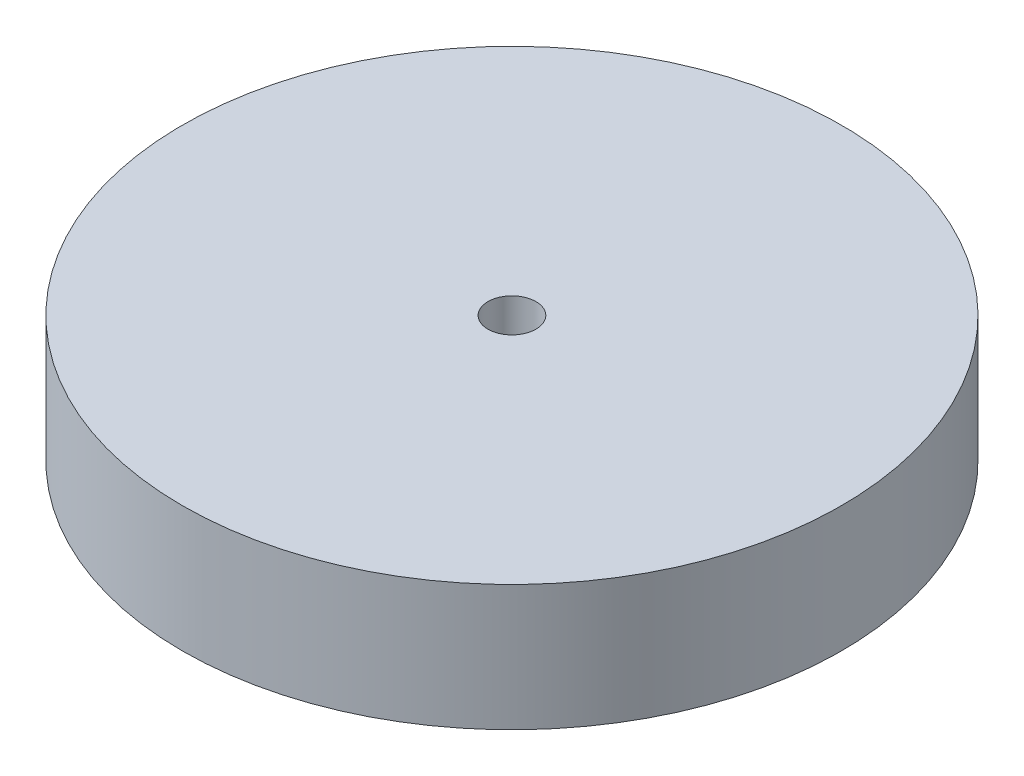
ISO-10303-21;
HEADER;
FILE_DESCRIPTION(('STEP AP214'),'2;1');
FILE_NAME('part.step','',(''),(''),'','','');
FILE_SCHEMA(('AUTOMOTIVE_DESIGN { 1 0 10303 214 1 1 1 1 }'));
ENDSEC;
DATA;
#1=APPLICATION_CONTEXT('core data for automotive mechanical design processes');
#2=APPLICATION_PROTOCOL_DEFINITION('international standard','automotive_design',2000,#1);
#3=PRODUCT_CONTEXT('',#1,'mechanical');
#4=PRODUCT('Part','Part','',(#3));
#5=PRODUCT_RELATED_PRODUCT_CATEGORY('part','',(#4));
#6=PRODUCT_DEFINITION_FORMATION('','',#4);
#7=PRODUCT_DEFINITION_CONTEXT('part definition',#1,'design');
#8=PRODUCT_DEFINITION('design','',#6,#7);
#9=PRODUCT_DEFINITION_SHAPE('','',#8);
#10=(LENGTH_UNIT() NAMED_UNIT(*) SI_UNIT(.MILLI.,.METRE.));
#11=(NAMED_UNIT(*) PLANE_ANGLE_UNIT() SI_UNIT($,.RADIAN.));
#12=(NAMED_UNIT(*) SI_UNIT($,.STERADIAN.) SOLID_ANGLE_UNIT());
#13=UNCERTAINTY_MEASURE_WITH_UNIT(LENGTH_MEASURE(1.E-05),#10,'distance_accuracy_value','');
#14=(GEOMETRIC_REPRESENTATION_CONTEXT(3) GLOBAL_UNCERTAINTY_ASSIGNED_CONTEXT((#13)) GLOBAL_UNIT_ASSIGNED_CONTEXT((#10,
#11,#12)) REPRESENTATION_CONTEXT('',''));
#15=CARTESIAN_POINT('',(0.,0.,0.));
#16=DIRECTION('',(0.,0.,1.));
#17=DIRECTION('',(1.,0.,0.));
#18=AXIS2_PLACEMENT_3D('',#15,#16,#17);
#19=CARTESIAN_POINT('',(0.,21.,0.));
#20=DIRECTION('',(0.,1.,0.));
#21=DIRECTION('',(0.,0.,1.));
#22=AXIS2_PLACEMENT_3D('',#19,#20,#21);
#23=PLANE('',#22);
#24=CARTESIAN_POINT('',(0.,21.,0.));
#25=DIRECTION('',(0.,1.,0.));
#26=DIRECTION('',(0.,0.,1.));
#27=AXIS2_PLACEMENT_3D('',#24,#25,#26);
#28=CIRCLE('',#27,55.);
#29=CARTESIAN_POINT('',(0.,21.,55.));
#30=VERTEX_POINT('',#29);
#31=EDGE_CURVE('E10',#30,#30,#28,.T.);
#32=ORIENTED_EDGE('',*,*,#31,.T.);
#33=EDGE_LOOP('',(#32));
#34=FACE_BOUND('',#33,.T.);
#35=CARTESIAN_POINT('',(0.,21.,0.));
#36=DIRECTION('',(0.,1.,0.));
#37=DIRECTION('',(0.,0.,1.));
#38=AXIS2_PLACEMENT_3D('',#35,#36,#37);
#39=CIRCLE('',#38,4.);
#40=CARTESIAN_POINT('',(0.,21.,4.));
#41=VERTEX_POINT('',#40);
#42=EDGE_CURVE('E46',#41,#41,#39,.T.);
#43=ORIENTED_EDGE('',*,*,#42,.F.);
#44=EDGE_LOOP('',(#43));
#45=FACE_BOUND('',#44,.T.);
#46=ADVANCED_FACE('F35',(#34,#45),#23,.T.);
#47=CARTESIAN_POINT('',(0.,0.,0.));
#48=DIRECTION('',(0.,1.,0.));
#49=DIRECTION('',(0.,0.,1.));
#50=AXIS2_PLACEMENT_3D('',#47,#48,#49);
#51=PLANE('',#50);
#52=CARTESIAN_POINT('',(0.,0.,0.));
#53=DIRECTION('',(0.,1.,0.));
#54=DIRECTION('',(0.,0.,1.));
#55=AXIS2_PLACEMENT_3D('',#52,#53,#54);
#56=CIRCLE('',#55,55.);
#57=CARTESIAN_POINT('',(0.,0.,55.));
#58=VERTEX_POINT('',#57);
#59=EDGE_CURVE('E39',#58,#58,#56,.T.);
#60=ORIENTED_EDGE('',*,*,#59,.F.);
#61=EDGE_LOOP('',(#60));
#62=FACE_BOUND('',#61,.T.);
#63=CARTESIAN_POINT('',(0.,0.,0.));
#64=DIRECTION('',(0.,1.,0.));
#65=DIRECTION('',(0.,0.,1.));
#66=AXIS2_PLACEMENT_3D('',#63,#64,#65);
#67=CIRCLE('',#66,4.);
#68=CARTESIAN_POINT('',(0.,0.,4.));
#69=VERTEX_POINT('',#68);
#70=EDGE_CURVE('E48',#69,#69,#67,.T.);
#71=ORIENTED_EDGE('',*,*,#70,.T.);
#72=EDGE_LOOP('',(#71));
#73=FACE_BOUND('',#72,.T.);
#74=ADVANCED_FACE('F58',(#62,#73),#51,.F.);
#75=CARTESIAN_POINT('',(0.,21.,0.));
#76=DIRECTION('',(0.,-1.,0.));
#77=DIRECTION('',(0.,0.,-1.));
#78=AXIS2_PLACEMENT_3D('',#75,#76,#77);
#79=CYLINDRICAL_SURFACE('',#78,55.);
#80=ORIENTED_EDGE('',*,*,#31,.F.);
#81=EDGE_LOOP('',(#80));
#82=FACE_BOUND('',#81,.T.);
#83=ORIENTED_EDGE('',*,*,#59,.T.);
#84=EDGE_LOOP('',(#83));
#85=FACE_BOUND('',#84,.T.);
#86=ADVANCED_FACE('F37',(#82,#85),#79,.T.);
#87=CARTESIAN_POINT('',(0.,21.,0.));
#88=DIRECTION('',(0.,-1.,0.));
#89=DIRECTION('',(0.,0.,-1.));
#90=AXIS2_PLACEMENT_3D('',#87,#88,#89);
#91=CYLINDRICAL_SURFACE('',#90,4.);
#92=ORIENTED_EDGE('',*,*,#42,.T.);
#93=EDGE_LOOP('',(#92));
#94=FACE_BOUND('',#93,.T.);
#95=ORIENTED_EDGE('',*,*,#70,.F.);
#96=EDGE_LOOP('',(#95));
#97=FACE_BOUND('',#96,.T.);
#98=ADVANCED_FACE('F54',(#94,#97),#91,.F.);
#99=CLOSED_SHELL('',(#46,#74,#86,#98));
#100=MANIFOLD_SOLID_BREP('B2',#99);
#101=ADVANCED_BREP_SHAPE_REPRESENTATION('',(#18,#100),#14);
#102=SHAPE_DEFINITION_REPRESENTATION(#9,#101);
ENDSEC;
END-ISO-10303-21;
